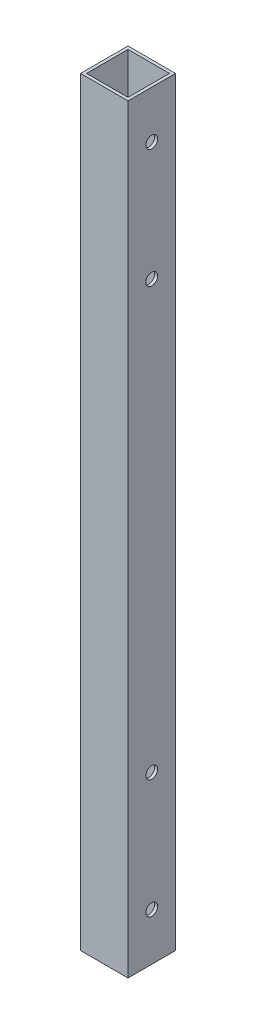
ISO-10303-21;
HEADER;
FILE_DESCRIPTION(('STEP AP214'),'2;1');
FILE_NAME('part.step','',(''),(''),'','','');
FILE_SCHEMA(('AUTOMOTIVE_DESIGN { 1 0 10303 214 1 1 1 1 }'));
ENDSEC;
DATA;
#1=APPLICATION_CONTEXT('core data for automotive mechanical design processes');
#2=APPLICATION_PROTOCOL_DEFINITION('international standard','automotive_design',2000,#1);
#3=PRODUCT_CONTEXT('',#1,'mechanical');
#4=PRODUCT('Part','Part','',(#3));
#5=PRODUCT_RELATED_PRODUCT_CATEGORY('part','',(#4));
#6=PRODUCT_DEFINITION_FORMATION('','',#4);
#7=PRODUCT_DEFINITION_CONTEXT('part definition',#1,'design');
#8=PRODUCT_DEFINITION('design','',#6,#7);
#9=PRODUCT_DEFINITION_SHAPE('','',#8);
#10=(LENGTH_UNIT() NAMED_UNIT(*) SI_UNIT(.MILLI.,.METRE.));
#11=(NAMED_UNIT(*) PLANE_ANGLE_UNIT() SI_UNIT($,.RADIAN.));
#12=(NAMED_UNIT(*) SI_UNIT($,.STERADIAN.) SOLID_ANGLE_UNIT());
#13=UNCERTAINTY_MEASURE_WITH_UNIT(LENGTH_MEASURE(1.E-05),#10,'distance_accuracy_value','');
#14=(GEOMETRIC_REPRESENTATION_CONTEXT(3) GLOBAL_UNCERTAINTY_ASSIGNED_CONTEXT((#13)) GLOBAL_UNIT_ASSIGNED_CONTEXT((#10,
#11,#12)) REPRESENTATION_CONTEXT('',''));
#15=CARTESIAN_POINT('',(0.,0.,0.));
#16=DIRECTION('',(0.,0.,1.));
#17=DIRECTION('',(1.,0.,0.));
#18=AXIS2_PLACEMENT_3D('',#15,#16,#17);
#19=CARTESIAN_POINT('',(0.,812.8,0.));
#20=DIRECTION('',(0.,1.,0.));
#21=DIRECTION('',(0.,0.,1.));
#22=AXIS2_PLACEMENT_3D('',#19,#20,#21);
#23=PLANE('',#22);
#24=DIRECTION('',(0.,0.,1.));
#25=VECTOR('',#24,1.);
#26=CARTESIAN_POINT('',(-25.4,812.8,-25.4));
#27=LINE('',#26,#25);
#28=CARTESIAN_POINT('',(-25.4,812.8,-25.4));
#29=VERTEX_POINT('',#28);
#30=CARTESIAN_POINT('',(-25.4,812.8,25.4));
#31=VERTEX_POINT('',#30);
#32=EDGE_CURVE('E137',#29,#31,#27,.T.);
#33=ORIENTED_EDGE('',*,*,#32,.T.);
#34=DIRECTION('',(1.,0.,0.));
#35=VECTOR('',#34,1.);
#36=CARTESIAN_POINT('',(-25.4,812.8,25.4));
#37=LINE('',#36,#35);
#38=CARTESIAN_POINT('',(25.4,812.8,25.4));
#39=VERTEX_POINT('',#38);
#40=EDGE_CURVE('E140',#31,#39,#37,.T.);
#41=ORIENTED_EDGE('',*,*,#40,.T.);
#42=DIRECTION('',(0.,0.,-1.));
#43=VECTOR('',#42,1.);
#44=CARTESIAN_POINT('',(25.4,812.8,-25.4));
#45=LINE('',#44,#43);
#46=CARTESIAN_POINT('',(25.4,812.8,-25.4));
#47=VERTEX_POINT('',#46);
#48=EDGE_CURVE('E143',#39,#47,#45,.T.);
#49=ORIENTED_EDGE('',*,*,#48,.T.);
#50=DIRECTION('',(-1.,0.,0.));
#51=VECTOR('',#50,1.);
#52=CARTESIAN_POINT('',(-25.4,812.8,-25.4));
#53=LINE('',#52,#51);
#54=EDGE_CURVE('E145',#47,#29,#53,.T.);
#55=ORIENTED_EDGE('',*,*,#54,.T.);
#56=EDGE_LOOP('',(#33,#41,#49,#55));
#57=FACE_BOUND('',#56,.T.);
#58=DIRECTION('',(1.,0.,0.));
#59=VECTOR('',#58,1.);
#60=CARTESIAN_POINT('',(-22.225,812.8,22.1917539267016));
#61=LINE('',#60,#59);
#62=CARTESIAN_POINT('',(-22.225,812.8,22.1917539267016));
#63=VERTEX_POINT('',#62);
#64=CARTESIAN_POINT('',(22.1917539267016,812.8,22.1917539267016));
#65=VERTEX_POINT('',#64);
#66=EDGE_CURVE('E107',#63,#65,#61,.T.);
#67=ORIENTED_EDGE('',*,*,#66,.F.);
#68=DIRECTION('',(0.,0.,1.));
#69=VECTOR('',#68,1.);
#70=CARTESIAN_POINT('',(-22.225,812.8,-22.225));
#71=LINE('',#70,#69);
#72=CARTESIAN_POINT('',(-22.225,812.8,-22.225));
#73=VERTEX_POINT('',#72);
#74=EDGE_CURVE('E99',#73,#63,#71,.T.);
#75=ORIENTED_EDGE('',*,*,#74,.F.);
#76=DIRECTION('',(-1.,0.,0.));
#77=VECTOR('',#76,1.);
#78=CARTESIAN_POINT('',(-22.225,812.8,-22.225));
#79=LINE('',#78,#77);
#80=CARTESIAN_POINT('',(22.1917539267016,812.8,-22.225));
#81=VERTEX_POINT('',#80);
#82=EDGE_CURVE('E121',#81,#73,#79,.T.);
#83=ORIENTED_EDGE('',*,*,#82,.F.);
#84=DIRECTION('',(0.,0.,-1.));
#85=VECTOR('',#84,1.);
#86=CARTESIAN_POINT('',(22.1917539267016,812.8,-22.225));
#87=LINE('',#86,#85);
#88=EDGE_CURVE('E119',#65,#81,#87,.T.);
#89=ORIENTED_EDGE('',*,*,#88,.F.);
#90=EDGE_LOOP('',(#67,#75,#83,#89));
#91=FACE_BOUND('',#90,.T.);
#92=ADVANCED_FACE('F32',(#57,#91),#23,.T.);
#93=CARTESIAN_POINT('',(0.,0.,0.));
#94=DIRECTION('',(0.,1.,0.));
#95=DIRECTION('',(0.,0.,1.));
#96=AXIS2_PLACEMENT_3D('',#93,#94,#95);
#97=PLANE('',#96);
#98=DIRECTION('',(0.,0.,1.));
#99=VECTOR('',#98,1.);
#100=CARTESIAN_POINT('',(-25.4,0.,-25.4));
#101=LINE('',#100,#99);
#102=CARTESIAN_POINT('',(-25.4,0.,-25.4));
#103=VERTEX_POINT('',#102);
#104=CARTESIAN_POINT('',(-25.4,0.,25.4));
#105=VERTEX_POINT('',#104);
#106=EDGE_CURVE('E115',#103,#105,#101,.T.);
#107=ORIENTED_EDGE('',*,*,#106,.F.);
#108=DIRECTION('',(-1.,0.,0.));
#109=VECTOR('',#108,1.);
#110=CARTESIAN_POINT('',(-25.4,0.,-25.4));
#111=LINE('',#110,#109);
#112=CARTESIAN_POINT('',(25.4,0.,-25.4));
#113=VERTEX_POINT('',#112);
#114=EDGE_CURVE('E141',#113,#103,#111,.T.);
#115=ORIENTED_EDGE('',*,*,#114,.F.);
#116=DIRECTION('',(0.,0.,-1.));
#117=VECTOR('',#116,1.);
#118=CARTESIAN_POINT('',(25.4,0.,-25.4));
#119=LINE('',#118,#117);
#120=CARTESIAN_POINT('',(25.4,0.,25.4));
#121=VERTEX_POINT('',#120);
#122=EDGE_CURVE('E152',#121,#113,#119,.T.);
#123=ORIENTED_EDGE('',*,*,#122,.F.);
#124=DIRECTION('',(1.,0.,0.));
#125=VECTOR('',#124,1.);
#126=CARTESIAN_POINT('',(-25.4,0.,25.4));
#127=LINE('',#126,#125);
#128=EDGE_CURVE('E150',#105,#121,#127,.T.);
#129=ORIENTED_EDGE('',*,*,#128,.F.);
#130=EDGE_LOOP('',(#107,#115,#123,#129));
#131=FACE_BOUND('',#130,.T.);
#132=DIRECTION('',(0.,0.,1.));
#133=VECTOR('',#132,1.);
#134=CARTESIAN_POINT('',(-22.225,0.,-22.225));
#135=LINE('',#134,#133);
#136=CARTESIAN_POINT('',(-22.225,0.,-22.225));
#137=VERTEX_POINT('',#136);
#138=CARTESIAN_POINT('',(-22.225,0.,22.1917539267016));
#139=VERTEX_POINT('',#138);
#140=EDGE_CURVE('E57',#137,#139,#135,.T.);
#141=ORIENTED_EDGE('',*,*,#140,.T.);
#142=DIRECTION('',(1.,0.,0.));
#143=VECTOR('',#142,1.);
#144=CARTESIAN_POINT('',(-22.225,0.,22.1917539267016));
#145=LINE('',#144,#143);
#146=CARTESIAN_POINT('',(22.1917539267016,0.,22.1917539267016));
#147=VERTEX_POINT('',#146);
#148=EDGE_CURVE('E114',#139,#147,#145,.T.);
#149=ORIENTED_EDGE('',*,*,#148,.T.);
#150=DIRECTION('',(0.,0.,-1.));
#151=VECTOR('',#150,1.);
#152=CARTESIAN_POINT('',(22.1917539267016,0.,-22.225));
#153=LINE('',#152,#151);
#154=CARTESIAN_POINT('',(22.1917539267016,0.,-22.225));
#155=VERTEX_POINT('',#154);
#156=EDGE_CURVE('E129',#147,#155,#153,.T.);
#157=ORIENTED_EDGE('',*,*,#156,.T.);
#158=DIRECTION('',(-1.,0.,0.));
#159=VECTOR('',#158,1.);
#160=CARTESIAN_POINT('',(-22.225,0.,-22.225));
#161=LINE('',#160,#159);
#162=EDGE_CURVE('E108',#155,#137,#161,.T.);
#163=ORIENTED_EDGE('',*,*,#162,.T.);
#164=EDGE_LOOP('',(#141,#149,#157,#163));
#165=FACE_BOUND('',#164,.T.);
#166=ADVANCED_FACE('F204',(#131,#165),#97,.F.);
#167=CARTESIAN_POINT('',(-25.4,812.8,-25.4));
#168=DIRECTION('',(1.,0.,0.));
#169=DIRECTION('',(0.,0.,-1.));
#170=AXIS2_PLACEMENT_3D('',#167,#168,#169);
#171=PLANE('',#170);
#172=CARTESIAN_POINT('',(-25.4,50.8,0.));
#173=DIRECTION('',(-1.,0.,0.));
#174=DIRECTION('',(0.,0.,1.));
#175=AXIS2_PLACEMENT_3D('',#172,#173,#174);
#176=CIRCLE('',#175,6.35);
#177=CARTESIAN_POINT('',(-25.4,50.8,6.35));
#178=VERTEX_POINT('',#177);
#179=EDGE_CURVE('E257',#178,#178,#176,.T.);
#180=ORIENTED_EDGE('',*,*,#179,.F.);
#181=EDGE_LOOP('',(#180));
#182=FACE_BOUND('',#181,.T.);
#183=CARTESIAN_POINT('',(-25.4,177.8,0.));
#184=DIRECTION('',(-1.,0.,0.));
#185=DIRECTION('',(0.,0.,1.));
#186=AXIS2_PLACEMENT_3D('',#183,#184,#185);
#187=CIRCLE('',#186,6.35);
#188=CARTESIAN_POINT('',(-25.4,177.8,6.35000000000005));
#189=VERTEX_POINT('',#188);
#190=EDGE_CURVE('E261',#189,#189,#187,.T.);
#191=ORIENTED_EDGE('',*,*,#190,.F.);
#192=EDGE_LOOP('',(#191));
#193=FACE_BOUND('',#192,.T.);
#194=CARTESIAN_POINT('',(-25.4,635.,0.));
#195=DIRECTION('',(-1.,0.,0.));
#196=DIRECTION('',(0.,0.,1.));
#197=AXIS2_PLACEMENT_3D('',#194,#195,#196);
#198=CIRCLE('',#197,6.35);
#199=CARTESIAN_POINT('',(-25.4,635.,6.34999999999991));
#200=VERTEX_POINT('',#199);
#201=EDGE_CURVE('E265',#200,#200,#198,.T.);
#202=ORIENTED_EDGE('',*,*,#201,.F.);
#203=EDGE_LOOP('',(#202));
#204=FACE_BOUND('',#203,.T.);
#205=CARTESIAN_POINT('',(-25.4,762.,0.));
#206=DIRECTION('',(-1.,0.,0.));
#207=DIRECTION('',(0.,0.,1.));
#208=AXIS2_PLACEMENT_3D('',#205,#206,#207);
#209=CIRCLE('',#208,6.35);
#210=CARTESIAN_POINT('',(-25.4,762.,6.34999999999992));
#211=VERTEX_POINT('',#210);
#212=EDGE_CURVE('E268',#211,#211,#209,.T.);
#213=ORIENTED_EDGE('',*,*,#212,.F.);
#214=EDGE_LOOP('',(#213));
#215=FACE_BOUND('',#214,.T.);
#216=ORIENTED_EDGE('',*,*,#106,.T.);
#217=DIRECTION('',(0.,-1.,0.));
#218=VECTOR('',#217,1.);
#219=CARTESIAN_POINT('',(-25.4,812.8,25.4));
#220=LINE('',#219,#218);
#221=EDGE_CURVE('E11',#31,#105,#220,.T.);
#222=ORIENTED_EDGE('',*,*,#221,.F.);
#223=ORIENTED_EDGE('',*,*,#32,.F.);
#224=DIRECTION('',(0.,-1.,0.));
#225=VECTOR('',#224,1.);
#226=CARTESIAN_POINT('',(-25.4,812.8,-25.4));
#227=LINE('',#226,#225);
#228=EDGE_CURVE('E147',#29,#103,#227,.T.);
#229=ORIENTED_EDGE('',*,*,#228,.T.);
#230=EDGE_LOOP('',(#216,#222,#223,#229));
#231=FACE_BOUND('',#230,.T.);
#232=ADVANCED_FACE('F34',(#182,#193,#204,#215,#231),#171,.F.);
#233=CARTESIAN_POINT('',(-25.4,812.8,25.4));
#234=DIRECTION('',(0.,0.,-1.));
#235=DIRECTION('',(-1.,0.,0.));
#236=AXIS2_PLACEMENT_3D('',#233,#234,#235);
#237=PLANE('',#236);
#238=ORIENTED_EDGE('',*,*,#128,.T.);
#239=DIRECTION('',(0.,-1.,0.));
#240=VECTOR('',#239,1.);
#241=CARTESIAN_POINT('',(25.4,812.8,25.4));
#242=LINE('',#241,#240);
#243=EDGE_CURVE('E41',#39,#121,#242,.T.);
#244=ORIENTED_EDGE('',*,*,#243,.F.);
#245=ORIENTED_EDGE('',*,*,#40,.F.);
#246=ORIENTED_EDGE('',*,*,#221,.T.);
#247=EDGE_LOOP('',(#238,#244,#245,#246));
#248=FACE_BOUND('',#247,.T.);
#249=ADVANCED_FACE('F232',(#248),#237,.F.);
#250=CARTESIAN_POINT('',(25.4,812.8,-25.4));
#251=DIRECTION('',(-1.,0.,0.));
#252=DIRECTION('',(0.,0.,1.));
#253=AXIS2_PLACEMENT_3D('',#250,#251,#252);
#254=PLANE('',#253);
#255=CARTESIAN_POINT('',(25.4,50.8,0.));
#256=DIRECTION('',(-1.,0.,0.));
#257=DIRECTION('',(0.,0.,1.));
#258=AXIS2_PLACEMENT_3D('',#255,#256,#257);
#259=CIRCLE('',#258,6.35);
#260=CARTESIAN_POINT('',(25.4,50.8,6.34999999999999));
#261=VERTEX_POINT('',#260);
#262=EDGE_CURVE('E166',#261,#261,#259,.T.);
#263=ORIENTED_EDGE('',*,*,#262,.T.);
#264=EDGE_LOOP('',(#263));
#265=FACE_BOUND('',#264,.T.);
#266=CARTESIAN_POINT('',(25.4,177.8,0.));
#267=DIRECTION('',(-1.,0.,0.));
#268=DIRECTION('',(0.,0.,1.));
#269=AXIS2_PLACEMENT_3D('',#266,#267,#268);
#270=CIRCLE('',#269,6.35);
#271=CARTESIAN_POINT('',(25.4,177.8,6.35000000000004));
#272=VERTEX_POINT('',#271);
#273=EDGE_CURVE('E279',#272,#272,#270,.T.);
#274=ORIENTED_EDGE('',*,*,#273,.T.);
#275=EDGE_LOOP('',(#274));
#276=FACE_BOUND('',#275,.T.);
#277=CARTESIAN_POINT('',(25.4,635.,0.));
#278=DIRECTION('',(-1.,0.,0.));
#279=DIRECTION('',(0.,0.,1.));
#280=AXIS2_PLACEMENT_3D('',#277,#278,#279);
#281=CIRCLE('',#280,6.35);
#282=CARTESIAN_POINT('',(25.4,635.,6.3499999999999));
#283=VERTEX_POINT('',#282);
#284=EDGE_CURVE('E275',#283,#283,#281,.T.);
#285=ORIENTED_EDGE('',*,*,#284,.T.);
#286=EDGE_LOOP('',(#285));
#287=FACE_BOUND('',#286,.T.);
#288=CARTESIAN_POINT('',(25.4,762.,0.));
#289=DIRECTION('',(-1.,0.,0.));
#290=DIRECTION('',(0.,0.,1.));
#291=AXIS2_PLACEMENT_3D('',#288,#289,#290);
#292=CIRCLE('',#291,6.35);
#293=CARTESIAN_POINT('',(25.4,762.,6.34999999999991));
#294=VERTEX_POINT('',#293);
#295=EDGE_CURVE('E270',#294,#294,#292,.T.);
#296=ORIENTED_EDGE('',*,*,#295,.T.);
#297=EDGE_LOOP('',(#296));
#298=FACE_BOUND('',#297,.T.);
#299=ORIENTED_EDGE('',*,*,#122,.T.);
#300=DIRECTION('',(0.,-1.,0.));
#301=VECTOR('',#300,1.);
#302=CARTESIAN_POINT('',(25.4,812.8,-25.4));
#303=LINE('',#302,#301);
#304=EDGE_CURVE('E157',#47,#113,#303,.T.);
#305=ORIENTED_EDGE('',*,*,#304,.F.);
#306=ORIENTED_EDGE('',*,*,#48,.F.);
#307=ORIENTED_EDGE('',*,*,#243,.T.);
#308=EDGE_LOOP('',(#299,#305,#306,#307));
#309=FACE_BOUND('',#308,.T.);
#310=ADVANCED_FACE('F229',(#265,#276,#287,#298,#309),#254,.F.);
#311=CARTESIAN_POINT('',(-25.4,812.8,-25.4));
#312=DIRECTION('',(0.,0.,1.));
#313=DIRECTION('',(1.,0.,0.));
#314=AXIS2_PLACEMENT_3D('',#311,#312,#313);
#315=PLANE('',#314);
#316=ORIENTED_EDGE('',*,*,#114,.T.);
#317=ORIENTED_EDGE('',*,*,#228,.F.);
#318=ORIENTED_EDGE('',*,*,#54,.F.);
#319=ORIENTED_EDGE('',*,*,#304,.T.);
#320=EDGE_LOOP('',(#316,#317,#318,#319));
#321=FACE_BOUND('',#320,.T.);
#322=ADVANCED_FACE('F226',(#321),#315,.F.);
#323=CARTESIAN_POINT('',(-22.225,812.8,-22.225));
#324=DIRECTION('',(1.,0.,0.));
#325=DIRECTION('',(0.,0.,-1.));
#326=AXIS2_PLACEMENT_3D('',#323,#324,#325);
#327=PLANE('',#326);
#328=CARTESIAN_POINT('',(-22.225,50.8,0.));
#329=DIRECTION('',(1.,0.,0.));
#330=DIRECTION('',(0.,0.,-1.));
#331=AXIS2_PLACEMENT_3D('',#328,#329,#330);
#332=CIRCLE('',#331,6.35);
#333=CARTESIAN_POINT('',(-22.225,50.8,-6.35));
#334=VERTEX_POINT('',#333);
#335=EDGE_CURVE('E127',#334,#334,#332,.T.);
#336=ORIENTED_EDGE('',*,*,#335,.F.);
#337=EDGE_LOOP('',(#336));
#338=FACE_BOUND('',#337,.T.);
#339=CARTESIAN_POINT('',(-22.225,177.8,0.));
#340=DIRECTION('',(1.,0.,0.));
#341=DIRECTION('',(0.,0.,-1.));
#342=AXIS2_PLACEMENT_3D('',#339,#340,#341);
#343=CIRCLE('',#342,6.35);
#344=CARTESIAN_POINT('',(-22.225,177.8,-6.34999999999995));
#345=VERTEX_POINT('',#344);
#346=EDGE_CURVE('E172',#345,#345,#343,.T.);
#347=ORIENTED_EDGE('',*,*,#346,.F.);
#348=EDGE_LOOP('',(#347));
#349=FACE_BOUND('',#348,.T.);
#350=CARTESIAN_POINT('',(-22.225,635.,0.));
#351=DIRECTION('',(1.,0.,0.));
#352=DIRECTION('',(0.,0.,-1.));
#353=AXIS2_PLACEMENT_3D('',#350,#351,#352);
#354=CIRCLE('',#353,6.35);
#355=CARTESIAN_POINT('',(-22.225,635.,-6.35000000000009));
#356=VERTEX_POINT('',#355);
#357=EDGE_CURVE('E169',#356,#356,#354,.T.);
#358=ORIENTED_EDGE('',*,*,#357,.F.);
#359=EDGE_LOOP('',(#358));
#360=FACE_BOUND('',#359,.T.);
#361=CARTESIAN_POINT('',(-22.225,762.,0.));
#362=DIRECTION('',(1.,0.,0.));
#363=DIRECTION('',(0.,0.,-1.));
#364=AXIS2_PLACEMENT_3D('',#361,#362,#363);
#365=CIRCLE('',#364,6.35);
#366=CARTESIAN_POINT('',(-22.225,762.,-6.35000000000008));
#367=VERTEX_POINT('',#366);
#368=EDGE_CURVE('E165',#367,#367,#365,.T.);
#369=ORIENTED_EDGE('',*,*,#368,.F.);
#370=EDGE_LOOP('',(#369));
#371=FACE_BOUND('',#370,.T.);
#372=ORIENTED_EDGE('',*,*,#140,.F.);
#373=DIRECTION('',(0.,-1.,0.));
#374=VECTOR('',#373,1.);
#375=CARTESIAN_POINT('',(-22.225,812.8,-22.225));
#376=LINE('',#375,#374);
#377=EDGE_CURVE('E103',#73,#137,#376,.T.);
#378=ORIENTED_EDGE('',*,*,#377,.F.);
#379=ORIENTED_EDGE('',*,*,#74,.T.);
#380=DIRECTION('',(0.,-1.,0.));
#381=VECTOR('',#380,1.);
#382=CARTESIAN_POINT('',(-22.225,812.8,22.1917539267016));
#383=LINE('',#382,#381);
#384=EDGE_CURVE('E102',#63,#139,#383,.T.);
#385=ORIENTED_EDGE('',*,*,#384,.T.);
#386=EDGE_LOOP('',(#372,#378,#379,#385));
#387=FACE_BOUND('',#386,.T.);
#388=ADVANCED_FACE('F101',(#338,#349,#360,#371,#387),#327,.T.);
#389=CARTESIAN_POINT('',(-22.225,812.8,22.1917539267016));
#390=DIRECTION('',(0.,0.,-1.));
#391=DIRECTION('',(-1.,0.,0.));
#392=AXIS2_PLACEMENT_3D('',#389,#390,#391);
#393=PLANE('',#392);
#394=ORIENTED_EDGE('',*,*,#148,.F.);
#395=ORIENTED_EDGE('',*,*,#384,.F.);
#396=ORIENTED_EDGE('',*,*,#66,.T.);
#397=DIRECTION('',(0.,-1.,0.));
#398=VECTOR('',#397,1.);
#399=CARTESIAN_POINT('',(22.1917539267016,812.8,22.1917539267016));
#400=LINE('',#399,#398);
#401=EDGE_CURVE('E116',#65,#147,#400,.T.);
#402=ORIENTED_EDGE('',*,*,#401,.T.);
#403=EDGE_LOOP('',(#394,#395,#396,#402));
#404=FACE_BOUND('',#403,.T.);
#405=ADVANCED_FACE('F111',(#404),#393,.T.);
#406=CARTESIAN_POINT('',(22.1917539267016,812.8,-22.225));
#407=DIRECTION('',(-1.,0.,0.));
#408=DIRECTION('',(0.,0.,1.));
#409=AXIS2_PLACEMENT_3D('',#406,#407,#408);
#410=PLANE('',#409);
#411=CARTESIAN_POINT('',(22.1917539267016,50.8,0.));
#412=DIRECTION('',(-1.,0.,0.));
#413=DIRECTION('',(0.,0.,1.));
#414=AXIS2_PLACEMENT_3D('',#411,#412,#413);
#415=CIRCLE('',#414,6.35);
#416=CARTESIAN_POINT('',(22.1917539267016,50.8,6.35));
#417=VERTEX_POINT('',#416);
#418=EDGE_CURVE('E36',#417,#417,#415,.T.);
#419=ORIENTED_EDGE('',*,*,#418,.F.);
#420=EDGE_LOOP('',(#419));
#421=FACE_BOUND('',#420,.T.);
#422=CARTESIAN_POINT('',(22.1917539267016,177.8,0.));
#423=DIRECTION('',(-1.,0.,0.));
#424=DIRECTION('',(0.,0.,1.));
#425=AXIS2_PLACEMENT_3D('',#422,#423,#424);
#426=CIRCLE('',#425,6.35);
#427=CARTESIAN_POINT('',(22.1917539267016,177.8,6.35000000000004));
#428=VERTEX_POINT('',#427);
#429=EDGE_CURVE('E170',#428,#428,#426,.T.);
#430=ORIENTED_EDGE('',*,*,#429,.F.);
#431=EDGE_LOOP('',(#430));
#432=FACE_BOUND('',#431,.T.);
#433=CARTESIAN_POINT('',(22.1917539267016,635.,0.));
#434=DIRECTION('',(-1.,0.,0.));
#435=DIRECTION('',(0.,0.,1.));
#436=AXIS2_PLACEMENT_3D('',#433,#434,#435);
#437=CIRCLE('',#436,6.35);
#438=CARTESIAN_POINT('',(22.1917539267016,635.,6.3499999999999));
#439=VERTEX_POINT('',#438);
#440=EDGE_CURVE('E167',#439,#439,#437,.T.);
#441=ORIENTED_EDGE('',*,*,#440,.F.);
#442=EDGE_LOOP('',(#441));
#443=FACE_BOUND('',#442,.T.);
#444=CARTESIAN_POINT('',(22.1917539267016,762.,0.));
#445=DIRECTION('',(-1.,0.,0.));
#446=DIRECTION('',(0.,0.,1.));
#447=AXIS2_PLACEMENT_3D('',#444,#445,#446);
#448=CIRCLE('',#447,6.35);
#449=CARTESIAN_POINT('',(22.1917539267016,762.,6.34999999999991));
#450=VERTEX_POINT('',#449);
#451=EDGE_CURVE('E162',#450,#450,#448,.T.);
#452=ORIENTED_EDGE('',*,*,#451,.F.);
#453=EDGE_LOOP('',(#452));
#454=FACE_BOUND('',#453,.T.);
#455=ORIENTED_EDGE('',*,*,#156,.F.);
#456=ORIENTED_EDGE('',*,*,#401,.F.);
#457=ORIENTED_EDGE('',*,*,#88,.T.);
#458=DIRECTION('',(0.,-1.,0.));
#459=VECTOR('',#458,1.);
#460=CARTESIAN_POINT('',(22.1917539267016,812.8,-22.225));
#461=LINE('',#460,#459);
#462=EDGE_CURVE('E49',#81,#155,#461,.T.);
#463=ORIENTED_EDGE('',*,*,#462,.T.);
#464=EDGE_LOOP('',(#455,#456,#457,#463));
#465=FACE_BOUND('',#464,.T.);
#466=ADVANCED_FACE('F192',(#421,#432,#443,#454,#465),#410,.T.);
#467=CARTESIAN_POINT('',(-22.225,812.8,-22.225));
#468=DIRECTION('',(0.,0.,1.));
#469=DIRECTION('',(1.,0.,0.));
#470=AXIS2_PLACEMENT_3D('',#467,#468,#469);
#471=PLANE('',#470);
#472=ORIENTED_EDGE('',*,*,#162,.F.);
#473=ORIENTED_EDGE('',*,*,#462,.F.);
#474=ORIENTED_EDGE('',*,*,#82,.T.);
#475=ORIENTED_EDGE('',*,*,#377,.T.);
#476=EDGE_LOOP('',(#472,#473,#474,#475));
#477=FACE_BOUND('',#476,.T.);
#478=ADVANCED_FACE('F195',(#477),#471,.T.);
#479=CARTESIAN_POINT('',(25.4,762.,0.));
#480=DIRECTION('',(-1.,0.,0.));
#481=DIRECTION('',(0.,0.,1.));
#482=AXIS2_PLACEMENT_3D('',#479,#480,#481);
#483=CYLINDRICAL_SURFACE('',#482,6.35);
#484=ORIENTED_EDGE('',*,*,#451,.T.);
#485=EDGE_LOOP('',(#484));
#486=FACE_BOUND('',#485,.T.);
#487=ORIENTED_EDGE('',*,*,#295,.F.);
#488=EDGE_LOOP('',(#487));
#489=FACE_BOUND('',#488,.T.);
#490=ADVANCED_FACE('F206',(#486,#489),#483,.F.);
#491=CARTESIAN_POINT('',(25.4,635.,0.));
#492=DIRECTION('',(-1.,0.,0.));
#493=DIRECTION('',(0.,0.,1.));
#494=AXIS2_PLACEMENT_3D('',#491,#492,#493);
#495=CYLINDRICAL_SURFACE('',#494,6.35);
#496=ORIENTED_EDGE('',*,*,#440,.T.);
#497=EDGE_LOOP('',(#496));
#498=FACE_BOUND('',#497,.T.);
#499=ORIENTED_EDGE('',*,*,#284,.F.);
#500=EDGE_LOOP('',(#499));
#501=FACE_BOUND('',#500,.T.);
#502=ADVANCED_FACE('F211',(#498,#501),#495,.F.);
#503=CARTESIAN_POINT('',(25.4,177.8,0.));
#504=DIRECTION('',(-1.,0.,0.));
#505=DIRECTION('',(0.,0.,1.));
#506=AXIS2_PLACEMENT_3D('',#503,#504,#505);
#507=CYLINDRICAL_SURFACE('',#506,6.35);
#508=ORIENTED_EDGE('',*,*,#429,.T.);
#509=EDGE_LOOP('',(#508));
#510=FACE_BOUND('',#509,.T.);
#511=ORIENTED_EDGE('',*,*,#273,.F.);
#512=EDGE_LOOP('',(#511));
#513=FACE_BOUND('',#512,.T.);
#514=ADVANCED_FACE('F287',(#510,#513),#507,.F.);
#515=CARTESIAN_POINT('',(25.4,50.8,0.));
#516=DIRECTION('',(-1.,0.,0.));
#517=DIRECTION('',(0.,0.,1.));
#518=AXIS2_PLACEMENT_3D('',#515,#516,#517);
#519=CYLINDRICAL_SURFACE('',#518,6.35);
#520=ORIENTED_EDGE('',*,*,#418,.T.);
#521=EDGE_LOOP('',(#520));
#522=FACE_BOUND('',#521,.T.);
#523=ORIENTED_EDGE('',*,*,#262,.F.);
#524=EDGE_LOOP('',(#523));
#525=FACE_BOUND('',#524,.T.);
#526=ADVANCED_FACE('F189',(#522,#525),#519,.F.);
#527=ORIENTED_EDGE('',*,*,#368,.T.);
#528=EDGE_LOOP('',(#527));
#529=FACE_BOUND('',#528,.T.);
#530=ORIENTED_EDGE('',*,*,#212,.T.);
#531=EDGE_LOOP('',(#530));
#532=FACE_BOUND('',#531,.T.);
#533=ADVANCED_FACE('F214',(#529,#532),#483,.F.);
#534=ORIENTED_EDGE('',*,*,#357,.T.);
#535=EDGE_LOOP('',(#534));
#536=FACE_BOUND('',#535,.T.);
#537=ORIENTED_EDGE('',*,*,#201,.T.);
#538=EDGE_LOOP('',(#537));
#539=FACE_BOUND('',#538,.T.);
#540=ADVANCED_FACE('F294',(#536,#539),#495,.F.);
#541=ORIENTED_EDGE('',*,*,#346,.T.);
#542=EDGE_LOOP('',(#541));
#543=FACE_BOUND('',#542,.T.);
#544=ORIENTED_EDGE('',*,*,#190,.T.);
#545=EDGE_LOOP('',(#544));
#546=FACE_BOUND('',#545,.T.);
#547=ADVANCED_FACE('F297',(#543,#546),#507,.F.);
#548=ORIENTED_EDGE('',*,*,#335,.T.);
#549=EDGE_LOOP('',(#548));
#550=FACE_BOUND('',#549,.T.);
#551=ORIENTED_EDGE('',*,*,#179,.T.);
#552=EDGE_LOOP('',(#551));
#553=FACE_BOUND('',#552,.T.);
#554=ADVANCED_FACE('F289',(#550,#553),#519,.F.);
#555=CLOSED_SHELL('',(#92,#166,#232,#249,#310,#322,#388,#405,#466,#478,#490,#502,#514,#526,#533,
#540,#547,#554));
#556=MANIFOLD_SOLID_BREP('B2',#555);
#557=ADVANCED_BREP_SHAPE_REPRESENTATION('',(#18,#556),#14);
#558=SHAPE_DEFINITION_REPRESENTATION(#9,#557);
ENDSEC;
END-ISO-10303-21;
